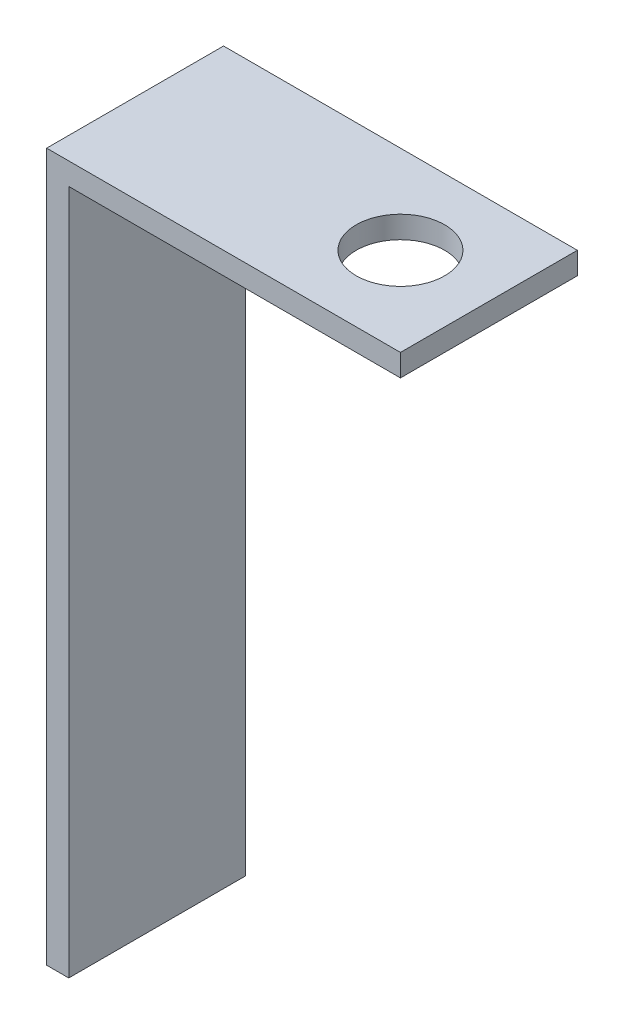
ISO-10303-21;
HEADER;
FILE_DESCRIPTION(('STEP AP214'),'2;1');
FILE_NAME('part.step','',(''),(''),'','','');
FILE_SCHEMA(('AUTOMOTIVE_DESIGN { 1 0 10303 214 1 1 1 1 }'));
ENDSEC;
DATA;
#1=APPLICATION_CONTEXT('core data for automotive mechanical design processes');
#2=APPLICATION_PROTOCOL_DEFINITION('international standard','automotive_design',2000,#1);
#3=PRODUCT_CONTEXT('',#1,'mechanical');
#4=PRODUCT('Part','Part','',(#3));
#5=PRODUCT_RELATED_PRODUCT_CATEGORY('part','',(#4));
#6=PRODUCT_DEFINITION_FORMATION('','',#4);
#7=PRODUCT_DEFINITION_CONTEXT('part definition',#1,'design');
#8=PRODUCT_DEFINITION('design','',#6,#7);
#9=PRODUCT_DEFINITION_SHAPE('','',#8);
#10=(LENGTH_UNIT() NAMED_UNIT(*) SI_UNIT(.MILLI.,.METRE.));
#11=(NAMED_UNIT(*) PLANE_ANGLE_UNIT() SI_UNIT($,.RADIAN.));
#12=(NAMED_UNIT(*) SI_UNIT($,.STERADIAN.) SOLID_ANGLE_UNIT());
#13=UNCERTAINTY_MEASURE_WITH_UNIT(LENGTH_MEASURE(1.E-05),#10,'distance_accuracy_value','');
#14=(GEOMETRIC_REPRESENTATION_CONTEXT(3) GLOBAL_UNCERTAINTY_ASSIGNED_CONTEXT((#13)) GLOBAL_UNIT_ASSIGNED_CONTEXT((#10,
#11,#12)) REPRESENTATION_CONTEXT('',''));
#15=CARTESIAN_POINT('',(0.,0.,0.));
#16=DIRECTION('',(0.,0.,1.));
#17=DIRECTION('',(1.,0.,0.));
#18=AXIS2_PLACEMENT_3D('',#15,#16,#17);
#19=CARTESIAN_POINT('',(0.,49.2125,12.7));
#20=DIRECTION('',(0.,1.,0.));
#21=DIRECTION('',(0.,0.,1.));
#22=AXIS2_PLACEMENT_3D('',#19,#20,#21);
#23=PLANE('',#22);
#24=CARTESIAN_POINT('',(19.05,49.2125,6.35));
#25=DIRECTION('',(0.,1.,0.));
#26=DIRECTION('',(0.,0.,1.));
#27=AXIS2_PLACEMENT_3D('',#24,#25,#26);
#28=CIRCLE('',#27,3.175);
#29=CARTESIAN_POINT('',(19.05,49.2125,9.525));
#30=VERTEX_POINT('',#29);
#31=EDGE_CURVE('E124',#30,#30,#28,.T.);
#32=ORIENTED_EDGE('',*,*,#31,.T.);
#33=EDGE_LOOP('',(#32));
#34=FACE_BOUND('',#33,.T.);
#35=DIRECTION('',(1.,0.,0.));
#36=VECTOR('',#35,1.);
#37=CARTESIAN_POINT('',(0.,49.2125,0.));
#38=LINE('',#37,#36);
#39=CARTESIAN_POINT('',(1.5875,49.2125,0.));
#40=VERTEX_POINT('',#39);
#41=CARTESIAN_POINT('',(25.4,49.2125,0.));
#42=VERTEX_POINT('',#41);
#43=EDGE_CURVE('E120',#40,#42,#38,.T.);
#44=ORIENTED_EDGE('',*,*,#43,.T.);
#45=DIRECTION('',(0.,0.,-1.));
#46=VECTOR('',#45,1.);
#47=CARTESIAN_POINT('',(25.4,49.2125,12.7));
#48=LINE('',#47,#46);
#49=CARTESIAN_POINT('',(25.4,49.2125,12.7));
#50=VERTEX_POINT('',#49);
#51=EDGE_CURVE('E11',#50,#42,#48,.T.);
#52=ORIENTED_EDGE('',*,*,#51,.F.);
#53=DIRECTION('',(1.,0.,0.));
#54=VECTOR('',#53,1.);
#55=CARTESIAN_POINT('',(0.,49.2125,12.7));
#56=LINE('',#55,#54);
#57=CARTESIAN_POINT('',(1.5875,49.2125,12.7));
#58=VERTEX_POINT('',#57);
#59=EDGE_CURVE('E85',#58,#50,#56,.T.);
#60=ORIENTED_EDGE('',*,*,#59,.F.);
#61=DIRECTION('',(0.,0.,-1.));
#62=VECTOR('',#61,1.);
#63=CARTESIAN_POINT('',(1.5875,49.2125,12.7));
#64=LINE('',#63,#62);
#65=EDGE_CURVE('E116',#58,#40,#64,.T.);
#66=ORIENTED_EDGE('',*,*,#65,.T.);
#67=EDGE_LOOP('',(#44,#52,#60,#66));
#68=FACE_BOUND('',#67,.T.);
#69=ADVANCED_FACE('F39',(#34,#68),#23,.F.);
#70=CARTESIAN_POINT('',(25.4,50.8,12.7));
#71=DIRECTION('',(1.,0.,0.));
#72=DIRECTION('',(0.,0.,-1.));
#73=AXIS2_PLACEMENT_3D('',#70,#71,#72);
#74=PLANE('',#73);
#75=DIRECTION('',(0.,-1.,0.));
#76=VECTOR('',#75,1.);
#77=CARTESIAN_POINT('',(25.4,50.8,0.));
#78=LINE('',#77,#76);
#79=CARTESIAN_POINT('',(25.4,50.8,0.));
#80=VERTEX_POINT('',#79);
#81=EDGE_CURVE('E123',#80,#42,#78,.T.);
#82=ORIENTED_EDGE('',*,*,#81,.F.);
#83=DIRECTION('',(0.,0.,-1.));
#84=VECTOR('',#83,1.);
#85=CARTESIAN_POINT('',(25.4,50.8,12.7));
#86=LINE('',#85,#84);
#87=CARTESIAN_POINT('',(25.4,50.8,12.7));
#88=VERTEX_POINT('',#87);
#89=EDGE_CURVE('E47',#88,#80,#86,.T.);
#90=ORIENTED_EDGE('',*,*,#89,.F.);
#91=DIRECTION('',(0.,-1.,0.));
#92=VECTOR('',#91,1.);
#93=CARTESIAN_POINT('',(25.4,50.8,12.7));
#94=LINE('',#93,#92);
#95=EDGE_CURVE('E171',#88,#50,#94,.T.);
#96=ORIENTED_EDGE('',*,*,#95,.T.);
#97=ORIENTED_EDGE('',*,*,#51,.T.);
#98=EDGE_LOOP('',(#82,#90,#96,#97));
#99=FACE_BOUND('',#98,.T.);
#100=ADVANCED_FACE('F142',(#99),#74,.T.);
#101=CARTESIAN_POINT('',(0.,50.8,12.7));
#102=DIRECTION('',(0.,1.,0.));
#103=DIRECTION('',(0.,0.,1.));
#104=AXIS2_PLACEMENT_3D('',#101,#102,#103);
#105=PLANE('',#104);
#106=CARTESIAN_POINT('',(19.05,50.8,6.35));
#107=DIRECTION('',(0.,1.,0.));
#108=DIRECTION('',(0.,0.,1.));
#109=AXIS2_PLACEMENT_3D('',#106,#107,#108);
#110=CIRCLE('',#109,3.175);
#111=CARTESIAN_POINT('',(19.05,50.8,9.525));
#112=VERTEX_POINT('',#111);
#113=EDGE_CURVE('E165',#112,#112,#110,.T.);
#114=ORIENTED_EDGE('',*,*,#113,.F.);
#115=EDGE_LOOP('',(#114));
#116=FACE_BOUND('',#115,.T.);
#117=DIRECTION('',(1.,0.,0.));
#118=VECTOR('',#117,1.);
#119=CARTESIAN_POINT('',(0.,50.8,0.));
#120=LINE('',#119,#118);
#121=CARTESIAN_POINT('',(0.,50.8,0.));
#122=VERTEX_POINT('',#121);
#123=EDGE_CURVE('E127',#122,#80,#120,.T.);
#124=ORIENTED_EDGE('',*,*,#123,.F.);
#125=DIRECTION('',(0.,0.,-1.));
#126=VECTOR('',#125,1.);
#127=CARTESIAN_POINT('',(0.,50.8,12.7));
#128=LINE('',#127,#126);
#129=CARTESIAN_POINT('',(0.,50.8,12.7));
#130=VERTEX_POINT('',#129);
#131=EDGE_CURVE('E106',#130,#122,#128,.T.);
#132=ORIENTED_EDGE('',*,*,#131,.F.);
#133=DIRECTION('',(1.,0.,0.));
#134=VECTOR('',#133,1.);
#135=CARTESIAN_POINT('',(0.,50.8,12.7));
#136=LINE('',#135,#134);
#137=EDGE_CURVE('E112',#130,#88,#136,.T.);
#138=ORIENTED_EDGE('',*,*,#137,.T.);
#139=ORIENTED_EDGE('',*,*,#89,.T.);
#140=EDGE_LOOP('',(#124,#132,#138,#139));
#141=FACE_BOUND('',#140,.T.);
#142=ADVANCED_FACE('F139',(#116,#141),#105,.T.);
#143=CARTESIAN_POINT('',(0.,0.,12.7));
#144=DIRECTION('',(-1.,0.,0.));
#145=DIRECTION('',(0.,0.,1.));
#146=AXIS2_PLACEMENT_3D('',#143,#144,#145);
#147=PLANE('',#146);
#148=DIRECTION('',(0.,1.,0.));
#149=VECTOR('',#148,1.);
#150=CARTESIAN_POINT('',(0.,0.,0.));
#151=LINE('',#150,#149);
#152=CARTESIAN_POINT('',(0.,0.,0.));
#153=VERTEX_POINT('',#152);
#154=EDGE_CURVE('E101',#153,#122,#151,.T.);
#155=ORIENTED_EDGE('',*,*,#154,.F.);
#156=DIRECTION('',(0.,0.,-1.));
#157=VECTOR('',#156,1.);
#158=CARTESIAN_POINT('',(0.,0.,12.7));
#159=LINE('',#158,#157);
#160=CARTESIAN_POINT('',(0.,0.,12.7));
#161=VERTEX_POINT('',#160);
#162=EDGE_CURVE('E96',#161,#153,#159,.T.);
#163=ORIENTED_EDGE('',*,*,#162,.F.);
#164=DIRECTION('',(0.,1.,0.));
#165=VECTOR('',#164,1.);
#166=CARTESIAN_POINT('',(0.,0.,12.7));
#167=LINE('',#166,#165);
#168=EDGE_CURVE('E99',#161,#130,#167,.T.);
#169=ORIENTED_EDGE('',*,*,#168,.T.);
#170=ORIENTED_EDGE('',*,*,#131,.T.);
#171=EDGE_LOOP('',(#155,#163,#169,#170));
#172=FACE_BOUND('',#171,.T.);
#173=ADVANCED_FACE('F98',(#172),#147,.T.);
#174=CARTESIAN_POINT('',(1.5875,0.,12.7));
#175=DIRECTION('',(0.,-1.,0.));
#176=DIRECTION('',(0.,0.,-1.));
#177=AXIS2_PLACEMENT_3D('',#174,#175,#176);
#178=PLANE('',#177);
#179=DIRECTION('',(-1.,0.,0.));
#180=VECTOR('',#179,1.);
#181=CARTESIAN_POINT('',(1.5875,0.,0.));
#182=LINE('',#181,#180);
#183=CARTESIAN_POINT('',(1.5875,0.,0.));
#184=VERTEX_POINT('',#183);
#185=EDGE_CURVE('E131',#184,#153,#182,.T.);
#186=ORIENTED_EDGE('',*,*,#185,.F.);
#187=DIRECTION('',(0.,0.,-1.));
#188=VECTOR('',#187,1.);
#189=CARTESIAN_POINT('',(1.5875,0.,12.7));
#190=LINE('',#189,#188);
#191=CARTESIAN_POINT('',(1.5875,0.,12.7));
#192=VERTEX_POINT('',#191);
#193=EDGE_CURVE('E76',#192,#184,#190,.T.);
#194=ORIENTED_EDGE('',*,*,#193,.F.);
#195=DIRECTION('',(-1.,0.,0.));
#196=VECTOR('',#195,1.);
#197=CARTESIAN_POINT('',(1.5875,0.,12.7));
#198=LINE('',#197,#196);
#199=EDGE_CURVE('E110',#192,#161,#198,.T.);
#200=ORIENTED_EDGE('',*,*,#199,.T.);
#201=ORIENTED_EDGE('',*,*,#162,.T.);
#202=EDGE_LOOP('',(#186,#194,#200,#201));
#203=FACE_BOUND('',#202,.T.);
#204=ADVANCED_FACE('F114',(#203),#178,.T.);
#205=CARTESIAN_POINT('',(1.5875,0.,12.7));
#206=DIRECTION('',(-1.,0.,0.));
#207=DIRECTION('',(0.,0.,1.));
#208=AXIS2_PLACEMENT_3D('',#205,#206,#207);
#209=PLANE('',#208);
#210=DIRECTION('',(0.,1.,0.));
#211=VECTOR('',#210,1.);
#212=CARTESIAN_POINT('',(1.5875,0.,0.));
#213=LINE('',#212,#211);
#214=EDGE_CURVE('E79',#184,#40,#213,.T.);
#215=ORIENTED_EDGE('',*,*,#214,.T.);
#216=ORIENTED_EDGE('',*,*,#65,.F.);
#217=DIRECTION('',(0.,1.,0.));
#218=VECTOR('',#217,1.);
#219=CARTESIAN_POINT('',(1.5875,0.,12.7));
#220=LINE('',#219,#218);
#221=EDGE_CURVE('E55',#192,#58,#220,.T.);
#222=ORIENTED_EDGE('',*,*,#221,.F.);
#223=ORIENTED_EDGE('',*,*,#193,.T.);
#224=EDGE_LOOP('',(#215,#216,#222,#223));
#225=FACE_BOUND('',#224,.T.);
#226=ADVANCED_FACE('F147',(#225),#209,.F.);
#227=CARTESIAN_POINT('',(0.,0.,12.7));
#228=DIRECTION('',(0.,0.,-1.));
#229=DIRECTION('',(-1.,0.,0.));
#230=AXIS2_PLACEMENT_3D('',#227,#228,#229);
#231=PLANE('',#230);
#232=ORIENTED_EDGE('',*,*,#59,.T.);
#233=ORIENTED_EDGE('',*,*,#95,.F.);
#234=ORIENTED_EDGE('',*,*,#137,.F.);
#235=ORIENTED_EDGE('',*,*,#168,.F.);
#236=ORIENTED_EDGE('',*,*,#199,.F.);
#237=ORIENTED_EDGE('',*,*,#221,.T.);
#238=EDGE_LOOP('',(#232,#233,#234,#235,#236,#237));
#239=FACE_BOUND('',#238,.T.);
#240=ADVANCED_FACE('F109',(#239),#231,.F.);
#241=CARTESIAN_POINT('',(0.,0.,0.));
#242=DIRECTION('',(0.,0.,-1.));
#243=DIRECTION('',(-1.,0.,0.));
#244=AXIS2_PLACEMENT_3D('',#241,#242,#243);
#245=PLANE('',#244);
#246=ORIENTED_EDGE('',*,*,#43,.F.);
#247=ORIENTED_EDGE('',*,*,#214,.F.);
#248=ORIENTED_EDGE('',*,*,#185,.T.);
#249=ORIENTED_EDGE('',*,*,#154,.T.);
#250=ORIENTED_EDGE('',*,*,#123,.T.);
#251=ORIENTED_EDGE('',*,*,#81,.T.);
#252=EDGE_LOOP('',(#246,#247,#248,#249,#250,#251));
#253=FACE_BOUND('',#252,.T.);
#254=ADVANCED_FACE('F145',(#253),#245,.T.);
#255=CARTESIAN_POINT('',(19.05,40.8,6.35));
#256=DIRECTION('',(0.,1.,0.));
#257=DIRECTION('',(0.,0.,1.));
#258=AXIS2_PLACEMENT_3D('',#255,#256,#257);
#259=CYLINDRICAL_SURFACE('',#258,3.175);
#260=ORIENTED_EDGE('',*,*,#113,.T.);
#261=EDGE_LOOP('',(#260));
#262=FACE_BOUND('',#261,.T.);
#263=ORIENTED_EDGE('',*,*,#31,.F.);
#264=EDGE_LOOP('',(#263));
#265=FACE_BOUND('',#264,.T.);
#266=ADVANCED_FACE('F174',(#262,#265),#259,.F.);
#267=CLOSED_SHELL('',(#69,#100,#142,#173,#204,#226,#240,#254,#266));
#268=MANIFOLD_SOLID_BREP('B2',#267);
#269=ADVANCED_BREP_SHAPE_REPRESENTATION('',(#18,#268),#14);
#270=SHAPE_DEFINITION_REPRESENTATION(#9,#269);
ENDSEC;
END-ISO-10303-21;
